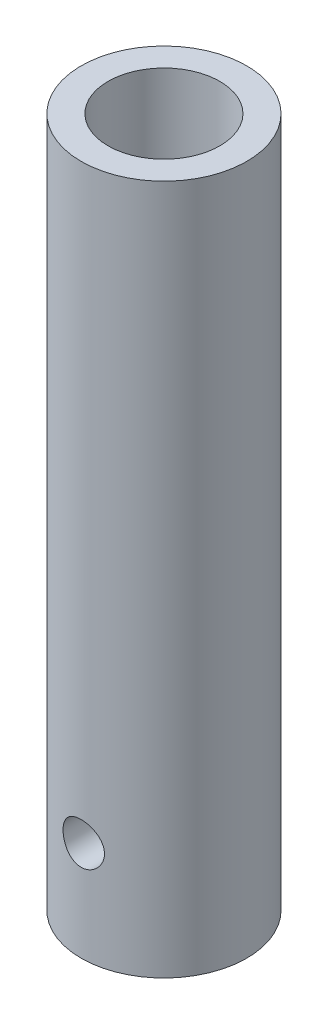
ISO-10303-21;
HEADER;
FILE_DESCRIPTION(('STEP AP214'),'2;1');
FILE_NAME('part.step','',(''),(''),'','','');
FILE_SCHEMA(('AUTOMOTIVE_DESIGN { 1 0 10303 214 1 1 1 1 }'));
ENDSEC;
DATA;
#1=APPLICATION_CONTEXT('core data for automotive mechanical design processes');
#2=APPLICATION_PROTOCOL_DEFINITION('international standard','automotive_design',2000,#1);
#3=PRODUCT_CONTEXT('',#1,'mechanical');
#4=PRODUCT('Part','Part','',(#3));
#5=PRODUCT_RELATED_PRODUCT_CATEGORY('part','',(#4));
#6=PRODUCT_DEFINITION_FORMATION('','',#4);
#7=PRODUCT_DEFINITION_CONTEXT('part definition',#1,'design');
#8=PRODUCT_DEFINITION('design','',#6,#7);
#9=PRODUCT_DEFINITION_SHAPE('','',#8);
#10=(LENGTH_UNIT() NAMED_UNIT(*) SI_UNIT(.MILLI.,.METRE.));
#11=(NAMED_UNIT(*) PLANE_ANGLE_UNIT() SI_UNIT($,.RADIAN.));
#12=(NAMED_UNIT(*) SI_UNIT($,.STERADIAN.) SOLID_ANGLE_UNIT());
#13=UNCERTAINTY_MEASURE_WITH_UNIT(LENGTH_MEASURE(1.E-05),#10,'distance_accuracy_value','');
#14=(GEOMETRIC_REPRESENTATION_CONTEXT(3) GLOBAL_UNCERTAINTY_ASSIGNED_CONTEXT((#13)) GLOBAL_UNIT_ASSIGNED_CONTEXT((#10,
#11,#12)) REPRESENTATION_CONTEXT('',''));
#15=CARTESIAN_POINT('',(0.,0.,0.));
#16=DIRECTION('',(0.,0.,1.));
#17=DIRECTION('',(1.,0.,0.));
#18=AXIS2_PLACEMENT_3D('',#15,#16,#17);
#19=CARTESIAN_POINT('',(0.,50.,0.));
#20=DIRECTION('',(0.,-1.,0.));
#21=DIRECTION('',(0.,0.,-1.));
#22=AXIS2_PLACEMENT_3D('',#19,#20,#21);
#23=CYLINDRICAL_SURFACE('',#22,6.);
#24=CARTESIAN_POINT('',(0.,8.7061971902355,-6.));
#25=CARTESIAN_POINT('',(-0.0828760886697314,8.70619486449734,-5.99999859868013));
#26=CARTESIAN_POINT('',(-0.165778157830764,8.69930563946171,-5.99826578131828));
#27=CARTESIAN_POINT('',(-0.329206323770533,8.6719720389285,-5.99152113829892));
#28=CARTESIAN_POINT('',(-0.409731046870739,8.65151998069766,-5.98650745419968));
#29=CARTESIAN_POINT('',(-0.566020872182577,8.59775793677342,-5.9737562633204));
#30=CARTESIAN_POINT('',(-0.641791563430003,8.56446339152023,-5.96602202842087));
#31=CARTESIAN_POINT('',(-0.786672131904426,8.48601580019067,-5.94865343807593));
#32=CARTESIAN_POINT('',(-0.855781784348759,8.44086235411657,-5.9390190185405));
#33=CARTESIAN_POINT('',(-0.986801927300919,8.33899640058129,-5.91867413591801));
#34=CARTESIAN_POINT('',(-1.04855569006107,8.28208561527633,-5.90794707148533));
#35=CARTESIAN_POINT('',(-1.1617489272033,8.15874498532659,-5.8867362011753));
#36=CARTESIAN_POINT('',(-1.21318723694913,8.09231406728901,-5.87625242288348));
#37=CARTESIAN_POINT('',(-1.30502654279903,7.95060196349807,-5.8565477569971));
#38=CARTESIAN_POINT('',(-1.34525221592536,7.8752039594251,-5.84734794470605));
#39=CARTESIAN_POINT('',(-1.41239690855053,7.71844877857714,-5.83149494812223));
#40=CARTESIAN_POINT('',(-1.43931805543933,7.63709255690974,-5.82484135672789));
#41=CARTESIAN_POINT('',(-1.47855483680429,7.47245369203303,-5.81500476717551));
#42=CARTESIAN_POINT('',(-1.49115226833334,7.38924229418571,-5.81175491075426));
#43=CARTESIAN_POINT('',(-1.50226177506785,7.22182862122152,-5.80889362537741));
#44=CARTESIAN_POINT('',(-1.50077614181798,7.13762650953689,-5.80928160448644));
#45=CARTESIAN_POINT('',(-1.48398652463928,6.97278138249102,-5.81359205496618));
#46=CARTESIAN_POINT('',(-1.46901834019052,6.89210156877041,-5.81742863001879));
#47=CARTESIAN_POINT('',(-1.42622418690311,6.73443613932421,-5.82806709676484));
#48=CARTESIAN_POINT('',(-1.39839730206942,6.65745078720652,-5.83486919970696));
#49=CARTESIAN_POINT('',(-1.33038947793715,6.50845917398344,-5.85075113904187));
#50=CARTESIAN_POINT('',(-1.29008666723291,6.43651101844595,-5.85985327469421));
#51=CARTESIAN_POINT('',(-1.19835627601495,6.30027848047867,-5.87929710846386));
#52=CARTESIAN_POINT('',(-1.14692674880884,6.23599544216825,-5.88963902334735));
#53=CARTESIAN_POINT('',(-1.03266342468122,6.11499357454111,-5.91075880539781));
#54=CARTESIAN_POINT('',(-0.969546258165861,6.05854270017416,-5.92154069477971));
#55=CARTESIAN_POINT('',(-0.834611917503701,5.9569759477716,-5.94205965578786));
#56=CARTESIAN_POINT('',(-0.762794477707944,5.91186041597194,-5.95179669549415));
#57=CARTESIAN_POINT('',(-0.612115888681392,5.83414660401112,-5.96917732094183));
#58=CARTESIAN_POINT('',(-0.533231393208624,5.80159184998108,-5.97681360127725));
#59=CARTESIAN_POINT('',(-0.370876008142884,5.75027988452593,-5.98907916991419));
#60=CARTESIAN_POINT('',(-0.287405999150486,5.73152003381737,-5.99370903339281));
#61=CARTESIAN_POINT('',(-0.120539970390028,5.70873962467667,-5.99935499271375));
#62=CARTESIAN_POINT('',(-0.0371967199882111,5.7043541641602,-6.00046053508279));
#63=CARTESIAN_POINT('',(0.129032874801507,5.70944619229099,-5.99918804814451));
#64=CARTESIAN_POINT('',(0.211919259644594,5.71892243303464,-5.99681033241847));
#65=CARTESIAN_POINT('',(0.373614268776491,5.75116809862688,-5.98889581127357));
#66=CARTESIAN_POINT('',(0.452465118968754,5.77373845371249,-5.98340634185811));
#67=CARTESIAN_POINT('',(0.60525729245251,5.83130427426395,-5.96988706634134));
#68=CARTESIAN_POINT('',(0.679198119032634,5.86630099454868,-5.96185700369892));
#69=CARTESIAN_POINT('',(0.821523134429847,5.94843331911023,-5.94393307926311));
#70=CARTESIAN_POINT('',(0.88978544183583,5.99577330263227,-5.93400867366932));
#71=CARTESIAN_POINT('',(1.01752661364325,6.10098709903248,-5.91344509187419));
#72=CARTESIAN_POINT('',(1.07700395897301,6.15886272985241,-5.90280579251705));
#73=CARTESIAN_POINT('',(1.18699056807273,6.28519915107997,-5.88168956960771));
#74=CARTESIAN_POINT('',(1.23724386762203,6.35388489323793,-5.87122304187281));
#75=CARTESIAN_POINT('',(1.3255107590127,6.49892982470122,-5.85192878377239));
#76=CARTESIAN_POINT('',(1.36352489415794,6.57528867319526,-5.84310098067026));
#77=CARTESIAN_POINT('',(1.42595142060929,6.73310291264858,-5.82818094734665));
#78=CARTESIAN_POINT('',(1.45044439665406,6.81452481857951,-5.82207255291906));
#79=CARTESIAN_POINT('',(1.48534565995378,6.98050682812461,-5.81326744090184));
#80=CARTESIAN_POINT('',(1.49575702747866,7.065066241268,-5.81056997719936));
#81=CARTESIAN_POINT('',(1.50203859033399,7.23231821409071,-5.80894901203957));
#82=CARTESIAN_POINT('',(1.49831789778012,7.31499462536024,-5.80991932728264));
#83=CARTESIAN_POINT('',(1.47737727831287,7.47850107890349,-5.81527909007843));
#84=CARTESIAN_POINT('',(1.46015762268677,7.55933115824916,-5.81966846891857));
#85=CARTESIAN_POINT('',(1.41293131944279,7.71640564930091,-5.83131260682723));
#86=CARTESIAN_POINT('',(1.38300140468038,7.79267449547571,-5.8385501523631));
#87=CARTESIAN_POINT('',(1.31126491360507,7.93916257294919,-5.85507755724829));
#88=CARTESIAN_POINT('',(1.26945669003419,8.00938096342242,-5.86436770120773));
#89=CARTESIAN_POINT('',(1.17386774863714,8.14375181923753,-5.88425634263512));
#90=CARTESIAN_POINT('',(1.11980316291226,8.20769826365946,-5.89488264831757));
#91=CARTESIAN_POINT('',(1.00178937118974,8.32574423503091,-5.91608027246286));
#92=CARTESIAN_POINT('',(0.937837821261147,8.37984142034847,-5.9266515772706));
#93=CARTESIAN_POINT('',(0.80046758670259,8.47760849880011,-5.94677655647663));
#94=CARTESIAN_POINT('',(0.726898422316386,8.52107180390708,-5.95630833365868));
#95=CARTESIAN_POINT('',(0.573266059510475,8.59494465317604,-5.97304924975118));
#96=CARTESIAN_POINT('',(0.493207563436739,8.62536355088404,-5.98026005199781));
#97=CARTESIAN_POINT('',(0.344410253243472,8.66776902056516,-5.99048059565542));
#98=CARTESIAN_POINT('',(0.276380170908069,8.68214843328894,-5.99402585052691));
#99=CARTESIAN_POINT('',(0.138906071536284,8.70136313385744,-5.99878605231948));
#100=CARTESIAN_POINT('',(0.0694621612426166,8.7061991395408,-6.00000117450894));
#101=CARTESIAN_POINT('',(0.,8.7061971902355,-6.));
#102=B_SPLINE_CURVE_WITH_KNOTS('',3,(#24,#25,#26,#27,#28,#29,#30,#31,#32,#33,#34,#35,#36,#37,
#38,#39,#40,#41,#42,#43,#44,#45,#46,#47,#48,#49,#50,#51,#52,#53,#54,#55,#56,#57,#58,#59,#60,#61,
#62,#63,#64,#65,#66,#67,#68,#69,#70,#71,#72,#73,#74,#75,#76,#77,#78,#79,#80,#81,#82,#83,#84,#85,
#86,#87,#88,#89,#90,#91,#92,#93,#94,#95,#96,#97,#98,#99,#100,#101),.UNSPECIFIED.,.T.,.F.,(4,2,2,
2,2,2,2,2,2,2,2,2,2,2,2,2,2,2,2,2,2,2,2,2,2,2,2,2,2,2,2,2,2,2,2,2,2,2,4),(0.,0.24837371247189,
0.496888237763899,0.745104902286104,0.993329940169327,1.24614435437139,1.49898729580062,
1.75558647545807,2.01214461169368,2.2635629509943,2.51494038112697,2.76022497007018,
3.00552703466038,3.25330527873879,3.50112690836162,3.75601500969019,4.01091089558247,
4.26668229009114,4.52240473688643,4.77158308949276,5.02073901112743,5.26620274514037,
5.5116912732229,5.76153587565352,6.01142363008019,6.26744509204476,6.52345518749508,
6.77792254614036,7.03233423252408,7.27943780398612,7.52653640956034,7.77216400559447,
8.01782568136901,8.2698957640991,8.52202569770417,8.77872185499588,9.0352336382135,
9.24342242942149,9.45159556043039),.UNSPECIFIED.);
#103=CARTESIAN_POINT('',(0.,8.7061971902355,-6.));
#104=VERTEX_POINT('',#103);
#105=EDGE_CURVE('E10',#104,#104,#102,.T.);
#106=ORIENTED_EDGE('',*,*,#105,.T.);
#107=EDGE_LOOP('',(#106));
#108=FACE_BOUND('',#107,.T.);
#109=CARTESIAN_POINT('',(1.5,7.20619719023551,5.80947501931113));
#110=CARTESIAN_POINT('',(1.49999764715507,7.12336673968074,5.80947660051185));
#111=CARTESIAN_POINT('',(1.49311574729838,7.04051025102871,5.81126583608348));
#112=CARTESIAN_POINT('',(1.46581387527848,6.87717664333108,5.81821117195949));
#113=CARTESIAN_POINT('',(1.44538602404532,6.79670093755451,5.82336923173088));
#114=CARTESIAN_POINT('',(1.39169471977917,6.64051506732328,5.8364323475758));
#115=CARTESIAN_POINT('',(1.35844783671268,6.5647988970041,5.84433385614245));
#116=CARTESIAN_POINT('',(1.28011268475685,6.42001067871155,5.86198915217285));
#117=CARTESIAN_POINT('',(1.23502391313642,6.35093891298737,5.87174301827101));
#118=CARTESIAN_POINT('',(1.13322505638713,6.21988020307818,5.89224429813367));
#119=CARTESIAN_POINT('',(1.07630213262243,6.15806103002548,5.90300758573818));
#120=CARTESIAN_POINT('',(0.952909238460399,6.0447403536193,5.92417725309178));
#121=CARTESIAN_POINT('',(0.886438376508184,5.99323981486246,5.93458359939834));
#122=CARTESIAN_POINT('',(0.744687120647372,5.90133190965674,5.95404249312349));
#123=CARTESIAN_POINT('',(0.669296745717072,5.86108935733863,5.96307412440355));
#124=CARTESIAN_POINT('',(0.512557910575657,5.79391140374365,5.9785848715559));
#125=CARTESIAN_POINT('',(0.431210331475164,5.7669740390862,5.98506436400607));
#126=CARTESIAN_POINT('',(0.266615255252497,5.72770848948835,5.99462855308908));
#127=CARTESIAN_POINT('',(0.183439631729385,5.71509540363956,5.99777936306589));
#128=CARTESIAN_POINT('',(0.0160972915576614,5.70394216267017,6.00056156464379));
#129=CARTESIAN_POINT('',(-0.0680692767228414,5.70539992690975,6.00019347658022));
#130=CARTESIAN_POINT('',(-0.233028370758581,5.72214210038559,5.99602856972121));
#131=CARTESIAN_POINT('',(-0.313854323401601,5.73711898526782,5.99230801404524));
#132=CARTESIAN_POINT('',(-0.47180737112053,5.7799799522646,5.98194501914912));
#133=CARTESIAN_POINT('',(-0.548934269055657,5.80786472146195,5.97530242439065));
#134=CARTESIAN_POINT('',(-0.69811005525271,5.87599873264774,5.95972505820537));
#135=CARTESIAN_POINT('',(-0.770106764649757,5.91635741703255,5.95077011817032));
#136=CARTESIAN_POINT('',(-0.906413433510734,6.00821059770526,5.9315394228579));
#137=CARTESIAN_POINT('',(-0.970722052628258,6.05970703137188,5.92126343791494));
#138=CARTESIAN_POINT('',(-1.09166105262743,6.17402243542493,5.90018228261712));
#139=CARTESIAN_POINT('',(-1.1480365186128,6.23711012564417,5.88937031715551));
#140=CARTESIAN_POINT('',(-1.24946456394453,6.37195717435966,5.86869026110024));
#141=CARTESIAN_POINT('',(-1.29451661406903,6.44371693793011,5.85882221463582));
#142=CARTESIAN_POINT('',(-1.3721821935339,6.59437121072489,5.84112298098989));
#143=CARTESIAN_POINT('',(-1.40473435045574,6.67329862842342,5.83330190235432));
#144=CARTESIAN_POINT('',(-1.45602843095451,6.83574847108138,5.82071184083974));
#145=CARTESIAN_POINT('',(-1.47477330982936,6.91926990862539,5.81594220486131));
#146=CARTESIAN_POINT('',(-1.49749778319911,7.08617289114938,5.81013213623485));
#147=CARTESIAN_POINT('',(-1.50185428435178,7.16949986623328,5.80899653456189));
#148=CARTESIAN_POINT('',(-1.49671019430933,7.3356903521824,5.81032406088624));
#149=CARTESIAN_POINT('',(-1.48721087870928,7.41855390500625,5.8127868576076));
#150=CARTESIAN_POINT('',(-1.4549552783626,7.58006574920833,5.82094249172736));
#151=CARTESIAN_POINT('',(-1.43241844096905,7.65876082617801,5.82658182140625));
#152=CARTESIAN_POINT('',(-1.37497084900237,7.81125606494652,5.84040430962577));
#153=CARTESIAN_POINT('',(-1.34005862862753,7.88505564566871,5.84858776949168));
#154=CARTESIAN_POINT('',(-1.25806240076193,8.02726195695591,5.86677682255957));
#155=CARTESIAN_POINT('',(-1.21075305230138,8.09553449426137,5.87681501163985));
#156=CARTESIAN_POINT('',(-1.10559043940168,8.22331020791632,5.8975024984303));
#157=CARTESIAN_POINT('',(-1.04773544220816,8.28281194022555,5.90815189637082));
#158=CARTESIAN_POINT('',(-0.92139408147709,8.39288381577808,5.92918441818964));
#159=CARTESIAN_POINT('',(-0.85267792879739,8.44319322776479,5.93955421237101));
#160=CARTESIAN_POINT('',(-0.707554024042014,8.53155871040625,5.95858329968241));
#161=CARTESIAN_POINT('',(-0.631146673436387,8.56961542020043,5.96724268202376));
#162=CARTESIAN_POINT('',(-0.473337302596636,8.63206481095226,5.98182069442989));
#163=CARTESIAN_POINT('',(-0.391976071541822,8.65655576086294,5.98775898013446));
#164=CARTESIAN_POINT('',(-0.226124640478212,8.69147339100055,5.99631176037473));
#165=CARTESIAN_POINT('',(-0.141635047561866,8.70190278547894,5.99892689636045));
#166=CARTESIAN_POINT('',(0.0256252896649888,8.70824857459881,6.00051254113217));
#167=CARTESIAN_POINT('',(0.108380740449049,8.70454975387859,5.99957968320012));
#168=CARTESIAN_POINT('',(0.272051244622109,8.68362544929401,5.99438844686135));
#169=CARTESIAN_POINT('',(0.352966352671329,8.66640036771585,5.99013016735643));
#170=CARTESIAN_POINT('',(0.510256553467224,8.61911886057911,5.97878149280944));
#171=CARTESIAN_POINT('',(0.586653741871529,8.58913201026357,5.97170646753999));
#172=CARTESIAN_POINT('',(0.733375579562203,8.51724132170652,5.95546933370076));
#173=CARTESIAN_POINT('',(0.803699461897577,8.47533598123116,5.94630696206604));
#174=CARTESIAN_POINT('',(0.938102892635848,8.3796243392399,5.92660874521999));
#175=CARTESIAN_POINT('',(1.00199248245087,8.32555697587444,5.91604525418417));
#176=CARTESIAN_POINT('',(1.11992253040688,8.20756291227481,5.89485973579863));
#177=CARTESIAN_POINT('',(1.17396048760228,8.14363371608865,5.88423769428834));
#178=CARTESIAN_POINT('',(1.27164303971884,8.00629506893351,5.86391213790822));
#179=CARTESIAN_POINT('',(1.31507492916982,7.93273100511656,5.85422945594827));
#180=CARTESIAN_POINT('',(1.3888903449235,7.77911395535145,5.83715933325924));
#181=CARTESIAN_POINT('',(1.41928336463958,7.69906574107539,5.82977022370054));
#182=CARTESIAN_POINT('',(1.46163379284816,7.55033167249543,5.81927863109675));
#183=CARTESIAN_POINT('',(1.47598975589307,7.48235744365971,5.8156299450082));
#184=CARTESIAN_POINT('',(1.4951734388599,7.34499388673556,5.81072757878358));
#185=CARTESIAN_POINT('',(1.50000197155828,7.27560467986791,5.80947369434945));
#186=CARTESIAN_POINT('',(1.5,7.20619719023551,5.80947501931113));
#187=B_SPLINE_CURVE_WITH_KNOTS('',3,(#109,#110,#111,#112,#113,#114,#115,#116,#117,#118,#119,
#120,#121,#122,#123,#124,#125,#126,#127,#128,#129,#130,#131,#132,#133,#134,#135,#136,#137,#138,
#139,#140,#141,#142,#143,#144,#145,#146,#147,#148,#149,#150,#151,#152,#153,#154,#155,#156,#157,
#158,#159,#160,#161,#162,#163,#164,#165,#166,#167,#168,#169,#170,#171,#172,#173,#174,#175,#176,
#177,#178,#179,#180,#181,#182,#183,#184,#185,#186),.UNSPECIFIED.,.T.,.F.,(4,2,2,2,2,2,2,2,2,2,2,
2,2,2,2,2,2,2,2,2,2,2,2,2,2,2,2,2,2,2,2,2,2,2,2,2,2,2,4),(0.,0.248236465041681,0.4966174448572,
0.744678436299613,0.99274996053287,1.24574372515786,1.4987611288792,1.75530897838752,
2.01181895908255,2.26313250597208,2.51440889199612,2.76010957613368,3.00582334034872,
3.25375724552667,3.50173431281348,3.75642279943147,4.01112318719881,4.26705859205042,
4.52293920077729,4.7720614485703,5.02116076310281,5.26618443005524,5.5112371285285,
5.76109707515494,6.01099811331027,6.26715198579191,6.52329249431732,6.77755243684157,
7.03176329345423,7.27910067676474,7.52643070426189,7.77242925935827,8.01845883442843,
8.27038257949242,8.52237018939305,8.77905886370806,9.03556032819972,9.24358696306398,
9.45159585059712),.UNSPECIFIED.);
#188=CARTESIAN_POINT('',(1.5,7.20619719023551,5.80947501931113));
#189=VERTEX_POINT('',#188);
#190=EDGE_CURVE('E42',#189,#189,#187,.T.);
#191=ORIENTED_EDGE('',*,*,#190,.T.);
#192=EDGE_LOOP('',(#191));
#193=FACE_BOUND('',#192,.T.);
#194=CARTESIAN_POINT('',(0.,50.,0.));
#195=DIRECTION('',(0.,1.,0.));
#196=DIRECTION('',(0.,0.,1.));
#197=AXIS2_PLACEMENT_3D('',#194,#195,#196);
#198=CIRCLE('',#197,6.);
#199=CARTESIAN_POINT('',(0.,50.,6.));
#200=VERTEX_POINT('',#199);
#201=EDGE_CURVE('E46',#200,#200,#198,.T.);
#202=ORIENTED_EDGE('',*,*,#201,.F.);
#203=EDGE_LOOP('',(#202));
#204=FACE_BOUND('',#203,.T.);
#205=CARTESIAN_POINT('',(0.,0.,0.));
#206=DIRECTION('',(0.,1.,0.));
#207=DIRECTION('',(0.,0.,1.));
#208=AXIS2_PLACEMENT_3D('',#205,#206,#207);
#209=CIRCLE('',#208,6.);
#210=CARTESIAN_POINT('',(0.,0.,6.));
#211=VERTEX_POINT('',#210);
#212=EDGE_CURVE('E50',#211,#211,#209,.T.);
#213=ORIENTED_EDGE('',*,*,#212,.T.);
#214=EDGE_LOOP('',(#213));
#215=FACE_BOUND('',#214,.T.);
#216=ADVANCED_FACE('F32',(#108,#193,#204,#215),#23,.T.);
#217=CARTESIAN_POINT('',(0.,50.,0.));
#218=DIRECTION('',(0.,1.,0.));
#219=DIRECTION('',(0.,0.,1.));
#220=AXIS2_PLACEMENT_3D('',#217,#218,#219);
#221=PLANE('',#220);
#222=CARTESIAN_POINT('',(0.,50.,0.));
#223=DIRECTION('',(0.,1.,0.));
#224=DIRECTION('',(0.,0.,1.));
#225=AXIS2_PLACEMENT_3D('',#222,#223,#224);
#226=CIRCLE('',#225,4.05);
#227=CARTESIAN_POINT('',(0.,50.,4.05));
#228=VERTEX_POINT('',#227);
#229=EDGE_CURVE('E87',#228,#228,#226,.T.);
#230=ORIENTED_EDGE('',*,*,#229,.F.);
#231=EDGE_LOOP('',(#230));
#232=FACE_BOUND('',#231,.T.);
#233=ORIENTED_EDGE('',*,*,#201,.T.);
#234=EDGE_LOOP('',(#233));
#235=FACE_BOUND('',#234,.T.);
#236=ADVANCED_FACE('F70',(#232,#235),#221,.T.);
#237=CARTESIAN_POINT('',(0.,0.,0.));
#238=DIRECTION('',(0.,1.,0.));
#239=DIRECTION('',(0.,0.,1.));
#240=AXIS2_PLACEMENT_3D('',#237,#238,#239);
#241=PLANE('',#240);
#242=ORIENTED_EDGE('',*,*,#212,.F.);
#243=EDGE_LOOP('',(#242));
#244=FACE_BOUND('',#243,.T.);
#245=ADVANCED_FACE('F68',(#244),#241,.F.);
#246=CARTESIAN_POINT('',(0.,35.,0.));
#247=DIRECTION('',(0.,1.,0.));
#248=DIRECTION('',(0.,0.,1.));
#249=AXIS2_PLACEMENT_3D('',#246,#247,#248);
#250=CYLINDRICAL_SURFACE('',#249,4.05);
#251=CARTESIAN_POINT('',(0.,35.,0.));
#252=DIRECTION('',(0.,1.,0.));
#253=DIRECTION('',(0.,0.,1.));
#254=AXIS2_PLACEMENT_3D('',#251,#252,#253);
#255=CIRCLE('',#254,4.05);
#256=CARTESIAN_POINT('',(0.,35.,4.05));
#257=VERTEX_POINT('',#256);
#258=EDGE_CURVE('E85',#257,#257,#255,.T.);
#259=ORIENTED_EDGE('',*,*,#258,.F.);
#260=EDGE_LOOP('',(#259));
#261=FACE_BOUND('',#260,.T.);
#262=ORIENTED_EDGE('',*,*,#229,.T.);
#263=EDGE_LOOP('',(#262));
#264=FACE_BOUND('',#263,.T.);
#265=ADVANCED_FACE('F64',(#261,#264),#250,.F.);
#266=CARTESIAN_POINT('',(0.,35.,0.));
#267=DIRECTION('',(0.,1.,0.));
#268=DIRECTION('',(0.,0.,1.));
#269=AXIS2_PLACEMENT_3D('',#266,#267,#268);
#270=PLANE('',#269);
#271=ORIENTED_EDGE('',*,*,#258,.T.);
#272=EDGE_LOOP('',(#271));
#273=FACE_BOUND('',#272,.T.);
#274=ADVANCED_FACE('F59',(#273),#270,.T.);
#275=CARTESIAN_POINT('',(0.,7.20619719023551,-6.));
#276=DIRECTION('',(0.,0.,1.));
#277=DIRECTION('',(1.,0.,0.));
#278=AXIS2_PLACEMENT_3D('',#275,#276,#277);
#279=CYLINDRICAL_SURFACE('',#278,1.5);
#280=ORIENTED_EDGE('',*,*,#190,.F.);
#281=EDGE_LOOP('',(#280));
#282=FACE_BOUND('',#281,.T.);
#283=ORIENTED_EDGE('',*,*,#105,.F.);
#284=EDGE_LOOP('',(#283));
#285=FACE_BOUND('',#284,.T.);
#286=ADVANCED_FACE('F55',(#282,#285),#279,.F.);
#287=CLOSED_SHELL('',(#216,#236,#245,#265,#274,#286));
#288=MANIFOLD_SOLID_BREP('B2',#287);
#289=ADVANCED_BREP_SHAPE_REPRESENTATION('',(#18,#288),#14);
#290=SHAPE_DEFINITION_REPRESENTATION(#9,#289);
ENDSEC;
END-ISO-10303-21;
